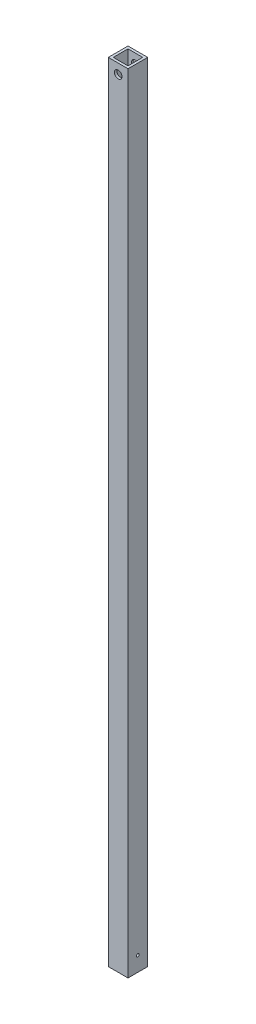
ISO-10303-21;
HEADER;
FILE_DESCRIPTION(('STEP AP214'),'2;1');
FILE_NAME('part.step','',(''),(''),'','','');
FILE_SCHEMA(('AUTOMOTIVE_DESIGN { 1 0 10303 214 1 1 1 1 }'));
ENDSEC;
DATA;
#1=APPLICATION_CONTEXT('core data for automotive mechanical design processes');
#2=APPLICATION_PROTOCOL_DEFINITION('international standard','automotive_design',2000,#1);
#3=PRODUCT_CONTEXT('',#1,'mechanical');
#4=PRODUCT('Part','Part','',(#3));
#5=PRODUCT_RELATED_PRODUCT_CATEGORY('part','',(#4));
#6=PRODUCT_DEFINITION_FORMATION('','',#4);
#7=PRODUCT_DEFINITION_CONTEXT('part definition',#1,'design');
#8=PRODUCT_DEFINITION('design','',#6,#7);
#9=PRODUCT_DEFINITION_SHAPE('','',#8);
#10=(LENGTH_UNIT() NAMED_UNIT(*) SI_UNIT(.MILLI.,.METRE.));
#11=(NAMED_UNIT(*) PLANE_ANGLE_UNIT() SI_UNIT($,.RADIAN.));
#12=(NAMED_UNIT(*) SI_UNIT($,.STERADIAN.) SOLID_ANGLE_UNIT());
#13=UNCERTAINTY_MEASURE_WITH_UNIT(LENGTH_MEASURE(1.E-05),#10,'distance_accuracy_value','');
#14=(GEOMETRIC_REPRESENTATION_CONTEXT(3) GLOBAL_UNCERTAINTY_ASSIGNED_CONTEXT((#13)) GLOBAL_UNIT_ASSIGNED_CONTEXT((#10,
#11,#12)) REPRESENTATION_CONTEXT('',''));
#15=CARTESIAN_POINT('',(0.,0.,0.));
#16=DIRECTION('',(0.,0.,1.));
#17=DIRECTION('',(1.,0.,0.));
#18=AXIS2_PLACEMENT_3D('',#15,#16,#17);
#19=CARTESIAN_POINT('',(0.,508.,0.));
#20=DIRECTION('',(0.,1.,0.));
#21=DIRECTION('',(0.,0.,1.));
#22=AXIS2_PLACEMENT_3D('',#19,#20,#21);
#23=PLANE('',#22);
#24=DIRECTION('',(0.,0.,-1.));
#25=VECTOR('',#24,1.);
#26=CARTESIAN_POINT('',(6.35,508.,-6.35));
#27=LINE('',#26,#25);
#28=CARTESIAN_POINT('',(6.35,508.,6.35));
#29=VERTEX_POINT('',#28);
#30=CARTESIAN_POINT('',(6.35,508.,-6.35));
#31=VERTEX_POINT('',#30);
#32=EDGE_CURVE('E161',#29,#31,#27,.T.);
#33=ORIENTED_EDGE('',*,*,#32,.T.);
#34=DIRECTION('',(-1.,0.,0.));
#35=VECTOR('',#34,1.);
#36=CARTESIAN_POINT('',(-6.35,508.,-6.35));
#37=LINE('',#36,#35);
#38=CARTESIAN_POINT('',(-6.35,508.,-6.35));
#39=VERTEX_POINT('',#38);
#40=EDGE_CURVE('E164',#31,#39,#37,.T.);
#41=ORIENTED_EDGE('',*,*,#40,.T.);
#42=DIRECTION('',(0.,0.,1.));
#43=VECTOR('',#42,1.);
#44=CARTESIAN_POINT('',(-6.35,508.,-6.35));
#45=LINE('',#44,#43);
#46=CARTESIAN_POINT('',(-6.35,508.,6.35));
#47=VERTEX_POINT('',#46);
#48=EDGE_CURVE('E167',#39,#47,#45,.T.);
#49=ORIENTED_EDGE('',*,*,#48,.T.);
#50=DIRECTION('',(1.,0.,0.));
#51=VECTOR('',#50,1.);
#52=CARTESIAN_POINT('',(-6.35,508.,6.35));
#53=LINE('',#52,#51);
#54=EDGE_CURVE('E169',#47,#29,#53,.T.);
#55=ORIENTED_EDGE('',*,*,#54,.T.);
#56=EDGE_LOOP('',(#33,#41,#49,#55));
#57=FACE_BOUND('',#56,.T.);
#58=DIRECTION('',(-1.,0.,0.));
#59=VECTOR('',#58,1.);
#60=CARTESIAN_POINT('',(-6.35,508.,-4.7625));
#61=LINE('',#60,#59);
#62=CARTESIAN_POINT('',(4.7625,508.,-4.7625));
#63=VERTEX_POINT('',#62);
#64=CARTESIAN_POINT('',(-4.7625,508.,-4.7625));
#65=VERTEX_POINT('',#64);
#66=EDGE_CURVE('E131',#63,#65,#61,.T.);
#67=ORIENTED_EDGE('',*,*,#66,.F.);
#68=DIRECTION('',(0.,0.,-1.));
#69=VECTOR('',#68,1.);
#70=CARTESIAN_POINT('',(4.7625,508.,-6.35));
#71=LINE('',#70,#69);
#72=CARTESIAN_POINT('',(4.7625,508.,4.7625));
#73=VERTEX_POINT('',#72);
#74=EDGE_CURVE('E123',#73,#63,#71,.T.);
#75=ORIENTED_EDGE('',*,*,#74,.F.);
#76=DIRECTION('',(1.,0.,0.));
#77=VECTOR('',#76,1.);
#78=CARTESIAN_POINT('',(-6.35,508.,4.7625));
#79=LINE('',#78,#77);
#80=CARTESIAN_POINT('',(-4.7625,508.,4.7625));
#81=VERTEX_POINT('',#80);
#82=EDGE_CURVE('E145',#81,#73,#79,.T.);
#83=ORIENTED_EDGE('',*,*,#82,.F.);
#84=DIRECTION('',(0.,0.,1.));
#85=VECTOR('',#84,1.);
#86=CARTESIAN_POINT('',(-4.7625,508.,-6.35));
#87=LINE('',#86,#85);
#88=EDGE_CURVE('E143',#65,#81,#87,.T.);
#89=ORIENTED_EDGE('',*,*,#88,.F.);
#90=EDGE_LOOP('',(#67,#75,#83,#89));
#91=FACE_BOUND('',#90,.T.);
#92=ADVANCED_FACE('F57',(#57,#91),#23,.T.);
#93=CARTESIAN_POINT('',(0.,0.,0.));
#94=DIRECTION('',(0.,1.,0.));
#95=DIRECTION('',(0.,0.,1.));
#96=AXIS2_PLACEMENT_3D('',#93,#94,#95);
#97=PLANE('',#96);
#98=DIRECTION('',(0.,0.,-1.));
#99=VECTOR('',#98,1.);
#100=CARTESIAN_POINT('',(6.35,0.,-6.35));
#101=LINE('',#100,#99);
#102=CARTESIAN_POINT('',(6.35,0.,6.35));
#103=VERTEX_POINT('',#102);
#104=CARTESIAN_POINT('',(6.35,0.,-6.35));
#105=VERTEX_POINT('',#104);
#106=EDGE_CURVE('E139',#103,#105,#101,.T.);
#107=ORIENTED_EDGE('',*,*,#106,.F.);
#108=DIRECTION('',(1.,0.,0.));
#109=VECTOR('',#108,1.);
#110=CARTESIAN_POINT('',(-6.35,0.,6.35));
#111=LINE('',#110,#109);
#112=CARTESIAN_POINT('',(-6.35,0.,6.35));
#113=VERTEX_POINT('',#112);
#114=EDGE_CURVE('E165',#113,#103,#111,.T.);
#115=ORIENTED_EDGE('',*,*,#114,.F.);
#116=DIRECTION('',(0.,0.,1.));
#117=VECTOR('',#116,1.);
#118=CARTESIAN_POINT('',(-6.35,0.,-6.35));
#119=LINE('',#118,#117);
#120=CARTESIAN_POINT('',(-6.35,0.,-6.35));
#121=VERTEX_POINT('',#120);
#122=EDGE_CURVE('E176',#121,#113,#119,.T.);
#123=ORIENTED_EDGE('',*,*,#122,.F.);
#124=DIRECTION('',(-1.,0.,0.));
#125=VECTOR('',#124,1.);
#126=CARTESIAN_POINT('',(-6.35,0.,-6.35));
#127=LINE('',#126,#125);
#128=EDGE_CURVE('E174',#105,#121,#127,.T.);
#129=ORIENTED_EDGE('',*,*,#128,.F.);
#130=EDGE_LOOP('',(#107,#115,#123,#129));
#131=FACE_BOUND('',#130,.T.);
#132=DIRECTION('',(0.,0.,-1.));
#133=VECTOR('',#132,1.);
#134=CARTESIAN_POINT('',(4.7625,0.,-6.35));
#135=LINE('',#134,#133);
#136=CARTESIAN_POINT('',(4.7625,0.,4.7625));
#137=VERTEX_POINT('',#136);
#138=CARTESIAN_POINT('',(4.7625,0.,-4.7625));
#139=VERTEX_POINT('',#138);
#140=EDGE_CURVE('E81',#137,#139,#135,.T.);
#141=ORIENTED_EDGE('',*,*,#140,.T.);
#142=DIRECTION('',(-1.,0.,0.));
#143=VECTOR('',#142,1.);
#144=CARTESIAN_POINT('',(-6.35,0.,-4.7625));
#145=LINE('',#144,#143);
#146=CARTESIAN_POINT('',(-4.7625,0.,-4.7625));
#147=VERTEX_POINT('',#146);
#148=EDGE_CURVE('E138',#139,#147,#145,.T.);
#149=ORIENTED_EDGE('',*,*,#148,.T.);
#150=DIRECTION('',(0.,0.,1.));
#151=VECTOR('',#150,1.);
#152=CARTESIAN_POINT('',(-4.7625,0.,-6.35));
#153=LINE('',#152,#151);
#154=CARTESIAN_POINT('',(-4.7625,0.,4.7625));
#155=VERTEX_POINT('',#154);
#156=EDGE_CURVE('E153',#147,#155,#153,.T.);
#157=ORIENTED_EDGE('',*,*,#156,.T.);
#158=DIRECTION('',(1.,0.,0.));
#159=VECTOR('',#158,1.);
#160=CARTESIAN_POINT('',(-6.35,0.,4.7625));
#161=LINE('',#160,#159);
#162=EDGE_CURVE('E132',#155,#137,#161,.T.);
#163=ORIENTED_EDGE('',*,*,#162,.T.);
#164=EDGE_LOOP('',(#141,#149,#157,#163));
#165=FACE_BOUND('',#164,.T.);
#166=ADVANCED_FACE('F195',(#131,#165),#97,.F.);
#167=CARTESIAN_POINT('',(6.35,508.,-6.35));
#168=DIRECTION('',(-1.,0.,0.));
#169=DIRECTION('',(0.,0.,1.));
#170=AXIS2_PLACEMENT_3D('',#167,#168,#169);
#171=PLANE('',#170);
#172=CARTESIAN_POINT('',(6.35,9.525,0.));
#173=DIRECTION('',(1.,0.,0.));
#174=DIRECTION('',(0.,0.,-1.));
#175=AXIS2_PLACEMENT_3D('',#172,#173,#174);
#176=CIRCLE('',#175,0.889);
#177=CARTESIAN_POINT('',(6.35,9.525,-0.889));
#178=VERTEX_POINT('',#177);
#179=EDGE_CURVE('E239',#178,#178,#176,.T.);
#180=ORIENTED_EDGE('',*,*,#179,.F.);
#181=EDGE_LOOP('',(#180));
#182=FACE_BOUND('',#181,.T.);
#183=ORIENTED_EDGE('',*,*,#106,.T.);
#184=DIRECTION('',(0.,-1.,0.));
#185=VECTOR('',#184,1.);
#186=CARTESIAN_POINT('',(6.35,508.,-6.35));
#187=LINE('',#186,#185);
#188=EDGE_CURVE('E12',#31,#105,#187,.T.);
#189=ORIENTED_EDGE('',*,*,#188,.F.);
#190=ORIENTED_EDGE('',*,*,#32,.F.);
#191=DIRECTION('',(0.,-1.,0.));
#192=VECTOR('',#191,1.);
#193=CARTESIAN_POINT('',(6.35,508.,6.35));
#194=LINE('',#193,#192);
#195=EDGE_CURVE('E171',#29,#103,#194,.T.);
#196=ORIENTED_EDGE('',*,*,#195,.T.);
#197=EDGE_LOOP('',(#183,#189,#190,#196));
#198=FACE_BOUND('',#197,.T.);
#199=ADVANCED_FACE('F59',(#182,#198),#171,.F.);
#200=CARTESIAN_POINT('',(-6.35,508.,-6.35));
#201=DIRECTION('',(0.,0.,1.));
#202=DIRECTION('',(1.,0.,0.));
#203=AXIS2_PLACEMENT_3D('',#200,#201,#202);
#204=PLANE('',#203);
#205=CARTESIAN_POINT('',(0.,501.65,-6.35));
#206=DIRECTION('',(0.,0.,1.));
#207=DIRECTION('',(1.,0.,0.));
#208=AXIS2_PLACEMENT_3D('',#205,#206,#207);
#209=CIRCLE('',#208,2.47649999999998);
#210=CARTESIAN_POINT('',(2.47649999999998,501.65,-6.35));
#211=VERTEX_POINT('',#210);
#212=EDGE_CURVE('E237',#211,#211,#209,.T.);
#213=ORIENTED_EDGE('',*,*,#212,.T.);
#214=EDGE_LOOP('',(#213));
#215=FACE_BOUND('',#214,.T.);
#216=ORIENTED_EDGE('',*,*,#128,.T.);
#217=DIRECTION('',(0.,-1.,0.));
#218=VECTOR('',#217,1.);
#219=CARTESIAN_POINT('',(-6.35,508.,-6.35));
#220=LINE('',#219,#218);
#221=EDGE_CURVE('E66',#39,#121,#220,.T.);
#222=ORIENTED_EDGE('',*,*,#221,.F.);
#223=ORIENTED_EDGE('',*,*,#40,.F.);
#224=ORIENTED_EDGE('',*,*,#188,.T.);
#225=EDGE_LOOP('',(#216,#222,#223,#224));
#226=FACE_BOUND('',#225,.T.);
#227=ADVANCED_FACE('F205',(#215,#226),#204,.F.);
#228=CARTESIAN_POINT('',(-6.35,508.,-6.35));
#229=DIRECTION('',(1.,0.,0.));
#230=DIRECTION('',(0.,0.,-1.));
#231=AXIS2_PLACEMENT_3D('',#228,#229,#230);
#232=PLANE('',#231);
#233=ORIENTED_EDGE('',*,*,#122,.T.);
#234=DIRECTION('',(0.,-1.,0.));
#235=VECTOR('',#234,1.);
#236=CARTESIAN_POINT('',(-6.35,508.,6.35));
#237=LINE('',#236,#235);
#238=EDGE_CURVE('E181',#47,#113,#237,.T.);
#239=ORIENTED_EDGE('',*,*,#238,.F.);
#240=ORIENTED_EDGE('',*,*,#48,.F.);
#241=ORIENTED_EDGE('',*,*,#221,.T.);
#242=EDGE_LOOP('',(#233,#239,#240,#241));
#243=FACE_BOUND('',#242,.T.);
#244=ADVANCED_FACE('F189',(#243),#232,.F.);
#245=CARTESIAN_POINT('',(-6.35,508.,6.35));
#246=DIRECTION('',(0.,0.,-1.));
#247=DIRECTION('',(-1.,0.,0.));
#248=AXIS2_PLACEMENT_3D('',#245,#246,#247);
#249=PLANE('',#248);
#250=CARTESIAN_POINT('',(0.,501.65,6.35));
#251=DIRECTION('',(0.,0.,-1.));
#252=DIRECTION('',(-1.,0.,0.));
#253=AXIS2_PLACEMENT_3D('',#250,#251,#252);
#254=CIRCLE('',#253,2.47649999999998);
#255=CARTESIAN_POINT('',(-2.47649999999998,501.65,6.35));
#256=VERTEX_POINT('',#255);
#257=EDGE_CURVE('E151',#256,#256,#254,.T.);
#258=ORIENTED_EDGE('',*,*,#257,.T.);
#259=EDGE_LOOP('',(#258));
#260=FACE_BOUND('',#259,.T.);
#261=ORIENTED_EDGE('',*,*,#114,.T.);
#262=ORIENTED_EDGE('',*,*,#195,.F.);
#263=ORIENTED_EDGE('',*,*,#54,.F.);
#264=ORIENTED_EDGE('',*,*,#238,.T.);
#265=EDGE_LOOP('',(#261,#262,#263,#264));
#266=FACE_BOUND('',#265,.T.);
#267=ADVANCED_FACE('F199',(#260,#266),#249,.F.);
#268=CARTESIAN_POINT('',(4.7625,508.,-6.35));
#269=DIRECTION('',(-1.,0.,0.));
#270=DIRECTION('',(0.,0.,1.));
#271=AXIS2_PLACEMENT_3D('',#268,#269,#270);
#272=PLANE('',#271);
#273=CARTESIAN_POINT('',(4.7625,9.525,0.));
#274=DIRECTION('',(-1.,0.,0.));
#275=DIRECTION('',(0.,0.,1.));
#276=AXIS2_PLACEMENT_3D('',#273,#274,#275);
#277=CIRCLE('',#276,0.889);
#278=CARTESIAN_POINT('',(4.7625,9.525,0.888999999999999));
#279=VERTEX_POINT('',#278);
#280=EDGE_CURVE('E242',#279,#279,#277,.F.);
#281=ORIENTED_EDGE('',*,*,#280,.T.);
#282=EDGE_LOOP('',(#281));
#283=FACE_BOUND('',#282,.T.);
#284=ORIENTED_EDGE('',*,*,#140,.F.);
#285=DIRECTION('',(0.,-1.,0.));
#286=VECTOR('',#285,1.);
#287=CARTESIAN_POINT('',(4.7625,508.,4.7625));
#288=LINE('',#287,#286);
#289=EDGE_CURVE('E127',#73,#137,#288,.T.);
#290=ORIENTED_EDGE('',*,*,#289,.F.);
#291=ORIENTED_EDGE('',*,*,#74,.T.);
#292=DIRECTION('',(0.,-1.,0.));
#293=VECTOR('',#292,1.);
#294=CARTESIAN_POINT('',(4.7625,508.,-4.7625));
#295=LINE('',#294,#293);
#296=EDGE_CURVE('E126',#63,#139,#295,.T.);
#297=ORIENTED_EDGE('',*,*,#296,.T.);
#298=EDGE_LOOP('',(#284,#290,#291,#297));
#299=FACE_BOUND('',#298,.T.);
#300=ADVANCED_FACE('F125',(#283,#299),#272,.T.);
#301=CARTESIAN_POINT('',(-6.35,508.,-4.7625));
#302=DIRECTION('',(0.,0.,1.));
#303=DIRECTION('',(1.,0.,0.));
#304=AXIS2_PLACEMENT_3D('',#301,#302,#303);
#305=PLANE('',#304);
#306=CARTESIAN_POINT('',(0.,501.65,-4.7625));
#307=DIRECTION('',(0.,0.,1.));
#308=DIRECTION('',(1.,0.,0.));
#309=AXIS2_PLACEMENT_3D('',#306,#307,#308);
#310=CIRCLE('',#309,2.47649999999998);
#311=CARTESIAN_POINT('',(2.47649999999998,501.65,-4.7625));
#312=VERTEX_POINT('',#311);
#313=EDGE_CURVE('E233',#312,#312,#310,.T.);
#314=ORIENTED_EDGE('',*,*,#313,.F.);
#315=EDGE_LOOP('',(#314));
#316=FACE_BOUND('',#315,.T.);
#317=ORIENTED_EDGE('',*,*,#148,.F.);
#318=ORIENTED_EDGE('',*,*,#296,.F.);
#319=ORIENTED_EDGE('',*,*,#66,.T.);
#320=DIRECTION('',(0.,-1.,0.));
#321=VECTOR('',#320,1.);
#322=CARTESIAN_POINT('',(-4.7625,508.,-4.7625));
#323=LINE('',#322,#321);
#324=EDGE_CURVE('E140',#65,#147,#323,.T.);
#325=ORIENTED_EDGE('',*,*,#324,.T.);
#326=EDGE_LOOP('',(#317,#318,#319,#325));
#327=FACE_BOUND('',#326,.T.);
#328=ADVANCED_FACE('F135',(#316,#327),#305,.T.);
#329=CARTESIAN_POINT('',(-4.7625,508.,-6.35));
#330=DIRECTION('',(1.,0.,0.));
#331=DIRECTION('',(0.,0.,-1.));
#332=AXIS2_PLACEMENT_3D('',#329,#330,#331);
#333=PLANE('',#332);
#334=ORIENTED_EDGE('',*,*,#156,.F.);
#335=ORIENTED_EDGE('',*,*,#324,.F.);
#336=ORIENTED_EDGE('',*,*,#88,.T.);
#337=DIRECTION('',(0.,-1.,0.));
#338=VECTOR('',#337,1.);
#339=CARTESIAN_POINT('',(-4.7625,508.,4.7625));
#340=LINE('',#339,#338);
#341=EDGE_CURVE('E73',#81,#155,#340,.T.);
#342=ORIENTED_EDGE('',*,*,#341,.T.);
#343=EDGE_LOOP('',(#334,#335,#336,#342));
#344=FACE_BOUND('',#343,.T.);
#345=ADVANCED_FACE('F264',(#344),#333,.T.);
#346=CARTESIAN_POINT('',(-6.35,508.,4.7625));
#347=DIRECTION('',(0.,0.,-1.));
#348=DIRECTION('',(-1.,0.,0.));
#349=AXIS2_PLACEMENT_3D('',#346,#347,#348);
#350=PLANE('',#349);
#351=CARTESIAN_POINT('',(0.,501.65,4.7625));
#352=DIRECTION('',(0.,0.,-1.));
#353=DIRECTION('',(-1.,0.,0.));
#354=AXIS2_PLACEMENT_3D('',#351,#352,#353);
#355=CIRCLE('',#354,2.47649999999998);
#356=CARTESIAN_POINT('',(-2.47649999999998,501.65,4.7625));
#357=VERTEX_POINT('',#356);
#358=EDGE_CURVE('E61',#357,#357,#355,.T.);
#359=ORIENTED_EDGE('',*,*,#358,.F.);
#360=EDGE_LOOP('',(#359));
#361=FACE_BOUND('',#360,.T.);
#362=ORIENTED_EDGE('',*,*,#162,.F.);
#363=ORIENTED_EDGE('',*,*,#341,.F.);
#364=ORIENTED_EDGE('',*,*,#82,.T.);
#365=ORIENTED_EDGE('',*,*,#289,.T.);
#366=EDGE_LOOP('',(#362,#363,#364,#365));
#367=FACE_BOUND('',#366,.T.);
#368=ADVANCED_FACE('F260',(#361,#367),#350,.T.);
#369=CARTESIAN_POINT('',(0.,501.65,-6.35));
#370=DIRECTION('',(0.,0.,1.));
#371=DIRECTION('',(1.,0.,0.));
#372=AXIS2_PLACEMENT_3D('',#369,#370,#371);
#373=CYLINDRICAL_SURFACE('',#372,2.47649999999998);
#374=ORIENTED_EDGE('',*,*,#358,.T.);
#375=EDGE_LOOP('',(#374));
#376=FACE_BOUND('',#375,.T.);
#377=ORIENTED_EDGE('',*,*,#257,.F.);
#378=EDGE_LOOP('',(#377));
#379=FACE_BOUND('',#378,.T.);
#380=ADVANCED_FACE('F255',(#376,#379),#373,.F.);
#381=ORIENTED_EDGE('',*,*,#313,.T.);
#382=EDGE_LOOP('',(#381));
#383=FACE_BOUND('',#382,.T.);
#384=ORIENTED_EDGE('',*,*,#212,.F.);
#385=EDGE_LOOP('',(#384));
#386=FACE_BOUND('',#385,.T.);
#387=ADVANCED_FACE('F249',(#383,#386),#373,.F.);
#388=CARTESIAN_POINT('',(-6.351,9.525,0.));
#389=DIRECTION('',(1.,0.,0.));
#390=DIRECTION('',(0.,0.,-1.));
#391=AXIS2_PLACEMENT_3D('',#388,#389,#390);
#392=CYLINDRICAL_SURFACE('',#391,0.889);
#393=ORIENTED_EDGE('',*,*,#280,.F.);
#394=EDGE_LOOP('',(#393));
#395=FACE_BOUND('',#394,.T.);
#396=ORIENTED_EDGE('',*,*,#179,.T.);
#397=EDGE_LOOP('',(#396));
#398=FACE_BOUND('',#397,.T.);
#399=ADVANCED_FACE('F246',(#395,#398),#392,.F.);
#400=CLOSED_SHELL('',(#92,#166,#199,#227,#244,#267,#300,#328,#345,#368,#380,#387,#399));
#401=MANIFOLD_SOLID_BREP('B2',#400);
#402=ADVANCED_BREP_SHAPE_REPRESENTATION('',(#18,#401),#14);
#403=SHAPE_DEFINITION_REPRESENTATION(#9,#402);
ENDSEC;
END-ISO-10303-21;
